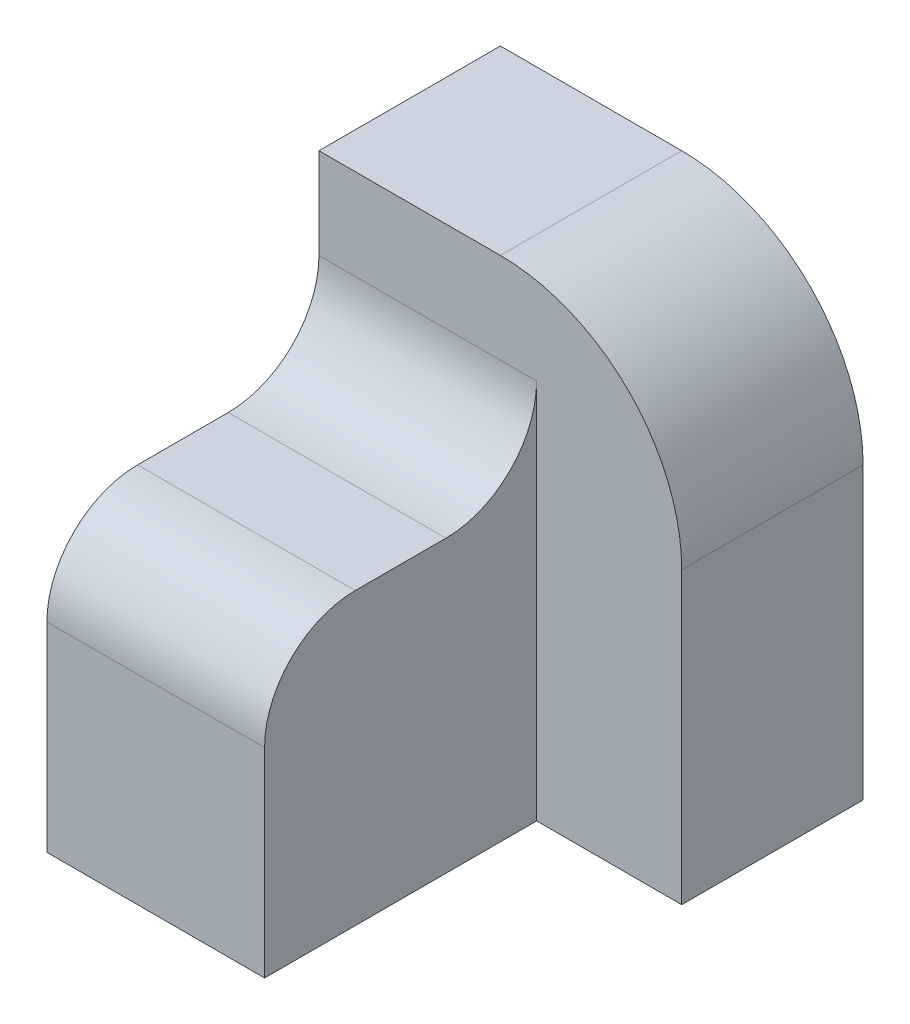
ISO-10303-21;
HEADER;
FILE_DESCRIPTION(('STEP AP214'),'2;1');
FILE_NAME('part.step','',(''),(''),'','','');
FILE_SCHEMA(('AUTOMOTIVE_DESIGN { 1 0 10303 214 1 1 1 1 }'));
ENDSEC;
DATA;
#1=APPLICATION_CONTEXT('core data for automotive mechanical design processes');
#2=APPLICATION_PROTOCOL_DEFINITION('international standard','automotive_design',2000,#1);
#3=PRODUCT_CONTEXT('',#1,'mechanical');
#4=PRODUCT('Part','Part','',(#3));
#5=PRODUCT_RELATED_PRODUCT_CATEGORY('part','',(#4));
#6=PRODUCT_DEFINITION_FORMATION('','',#4);
#7=PRODUCT_DEFINITION_CONTEXT('part definition',#1,'design');
#8=PRODUCT_DEFINITION('design','',#6,#7);
#9=PRODUCT_DEFINITION_SHAPE('','',#8);
#10=(LENGTH_UNIT() NAMED_UNIT(*) SI_UNIT(.MILLI.,.METRE.));
#11=(NAMED_UNIT(*) PLANE_ANGLE_UNIT() SI_UNIT($,.RADIAN.));
#12=(NAMED_UNIT(*) SI_UNIT($,.STERADIAN.) SOLID_ANGLE_UNIT());
#13=UNCERTAINTY_MEASURE_WITH_UNIT(LENGTH_MEASURE(1.E-05),#10,'distance_accuracy_value','');
#14=(GEOMETRIC_REPRESENTATION_CONTEXT(3) GLOBAL_UNCERTAINTY_ASSIGNED_CONTEXT((#13)) GLOBAL_UNIT_ASSIGNED_CONTEXT((#10,
#11,#12)) REPRESENTATION_CONTEXT('',''));
#15=CARTESIAN_POINT('',(0.,0.,0.));
#16=DIRECTION('',(0.,0.,1.));
#17=DIRECTION('',(1.,0.,0.));
#18=AXIS2_PLACEMENT_3D('',#15,#16,#17);
#19=CARTESIAN_POINT('',(0.,52.,-30.));
#20=DIRECTION('',(0.,0.,1.));
#21=DIRECTION('',(1.,0.,0.));
#22=AXIS2_PLACEMENT_3D('',#19,#20,#21);
#23=PLANE('',#22);
#24=DIRECTION('',(0.,-1.,0.));
#25=VECTOR('',#24,1.);
#26=CARTESIAN_POINT('',(40.,52.,-30.));
#27=LINE('',#26,#25);
#28=CARTESIAN_POINT('',(40.,32.,-30.));
#29=VERTEX_POINT('',#28);
#30=CARTESIAN_POINT('',(40.,0.,-30.));
#31=VERTEX_POINT('',#30);
#32=EDGE_CURVE('E134',#29,#31,#27,.T.);
#33=ORIENTED_EDGE('',*,*,#32,.F.);
#34=CARTESIAN_POINT('',(20.,32.,-30.));
#35=DIRECTION('',(0.,0.,1.));
#36=DIRECTION('',(1.,0.,0.));
#37=AXIS2_PLACEMENT_3D('',#34,#35,#36);
#38=CIRCLE('',#37,20.);
#39=CARTESIAN_POINT('',(20.,52.,-30.));
#40=VERTEX_POINT('',#39);
#41=EDGE_CURVE('E115',#40,#29,#38,.F.);
#42=ORIENTED_EDGE('',*,*,#41,.F.);
#43=DIRECTION('',(-1.,0.,0.));
#44=VECTOR('',#43,1.);
#45=CARTESIAN_POINT('',(0.,52.,-30.));
#46=LINE('',#45,#44);
#47=CARTESIAN_POINT('',(0.,52.,-30.));
#48=VERTEX_POINT('',#47);
#49=EDGE_CURVE('E311',#40,#48,#46,.T.);
#50=ORIENTED_EDGE('',*,*,#49,.T.);
#51=DIRECTION('',(0.,-1.,0.));
#52=VECTOR('',#51,1.);
#53=CARTESIAN_POINT('',(0.,52.,-30.));
#54=LINE('',#53,#52);
#55=CARTESIAN_POINT('',(0.,42.,-30.));
#56=VERTEX_POINT('',#55);
#57=EDGE_CURVE('E60',#48,#56,#54,.T.);
#58=ORIENTED_EDGE('',*,*,#57,.T.);
#59=DIRECTION('',(-1.,0.,0.));
#60=VECTOR('',#59,1.);
#61=CARTESIAN_POINT('',(119.057565652784,42.,-30.));
#62=LINE('',#61,#60);
#63=CARTESIAN_POINT('',(24.,42.,-30.));
#64=VERTEX_POINT('',#63);
#65=EDGE_CURVE('E137',#64,#56,#62,.T.);
#66=ORIENTED_EDGE('',*,*,#65,.F.);
#67=DIRECTION('',(0.,-1.,0.));
#68=VECTOR('',#67,1.);
#69=CARTESIAN_POINT('',(24.,60.,-30.));
#70=LINE('',#69,#68);
#71=CARTESIAN_POINT('',(24.,0.,-30.));
#72=VERTEX_POINT('',#71);
#73=EDGE_CURVE('E172',#64,#72,#70,.T.);
#74=ORIENTED_EDGE('',*,*,#73,.T.);
#75=DIRECTION('',(-1.,0.,0.));
#76=VECTOR('',#75,1.);
#77=CARTESIAN_POINT('',(0.,0.,-30.));
#78=LINE('',#77,#76);
#79=EDGE_CURVE('E199',#31,#72,#78,.T.);
#80=ORIENTED_EDGE('',*,*,#79,.F.);
#81=EDGE_LOOP('',(#33,#42,#50,#58,#66,#74,#80));
#82=FACE_BOUND('',#81,.T.);
#83=ADVANCED_FACE('F37',(#82),#23,.T.);
#84=CARTESIAN_POINT('',(0.,52.,-50.));
#85=DIRECTION('',(0.,0.,-1.));
#86=DIRECTION('',(-1.,0.,0.));
#87=AXIS2_PLACEMENT_3D('',#84,#85,#86);
#88=PLANE('',#87);
#89=DIRECTION('',(1.,0.,0.));
#90=VECTOR('',#89,1.);
#91=CARTESIAN_POINT('',(0.,52.,-50.));
#92=LINE('',#91,#90);
#93=CARTESIAN_POINT('',(0.,52.,-50.));
#94=VERTEX_POINT('',#93);
#95=CARTESIAN_POINT('',(20.,52.,-50.));
#96=VERTEX_POINT('',#95);
#97=EDGE_CURVE('E128',#94,#96,#92,.T.);
#98=ORIENTED_EDGE('',*,*,#97,.T.);
#99=CARTESIAN_POINT('',(20.,32.,-50.));
#100=DIRECTION('',(0.,0.,1.));
#101=DIRECTION('',(1.,0.,0.));
#102=AXIS2_PLACEMENT_3D('',#99,#100,#101);
#103=CIRCLE('',#102,20.);
#104=CARTESIAN_POINT('',(40.,32.,-50.));
#105=VERTEX_POINT('',#104);
#106=EDGE_CURVE('E52',#96,#105,#103,.F.);
#107=ORIENTED_EDGE('',*,*,#106,.T.);
#108=DIRECTION('',(0.,-1.,0.));
#109=VECTOR('',#108,1.);
#110=CARTESIAN_POINT('',(40.,52.,-50.));
#111=LINE('',#110,#109);
#112=CARTESIAN_POINT('',(40.,0.,-50.));
#113=VERTEX_POINT('',#112);
#114=EDGE_CURVE('E125',#105,#113,#111,.T.);
#115=ORIENTED_EDGE('',*,*,#114,.T.);
#116=DIRECTION('',(1.,0.,0.));
#117=VECTOR('',#116,1.);
#118=CARTESIAN_POINT('',(0.,0.,-50.));
#119=LINE('',#118,#117);
#120=CARTESIAN_POINT('',(0.,0.,-50.));
#121=VERTEX_POINT('',#120);
#122=EDGE_CURVE('E314',#121,#113,#119,.T.);
#123=ORIENTED_EDGE('',*,*,#122,.F.);
#124=DIRECTION('',(0.,-1.,0.));
#125=VECTOR('',#124,1.);
#126=CARTESIAN_POINT('',(0.,52.,-50.));
#127=LINE('',#126,#125);
#128=EDGE_CURVE('E135',#94,#121,#127,.T.);
#129=ORIENTED_EDGE('',*,*,#128,.F.);
#130=EDGE_LOOP('',(#98,#107,#115,#123,#129));
#131=FACE_BOUND('',#130,.T.);
#132=ADVANCED_FACE('F123',(#131),#88,.T.);
#133=CARTESIAN_POINT('',(0.,52.,0.));
#134=DIRECTION('',(0.,1.,0.));
#135=DIRECTION('',(0.,0.,1.));
#136=AXIS2_PLACEMENT_3D('',#133,#134,#135);
#137=PLANE('',#136);
#138=ORIENTED_EDGE('',*,*,#49,.F.);
#139=DIRECTION('',(0.,0.,-1.));
#140=VECTOR('',#139,1.);
#141=CARTESIAN_POINT('',(20.,52.,110.607953136506));
#142=LINE('',#141,#140);
#143=EDGE_CURVE('E119',#40,#96,#142,.T.);
#144=ORIENTED_EDGE('',*,*,#143,.T.);
#145=ORIENTED_EDGE('',*,*,#97,.F.);
#146=DIRECTION('',(0.,0.,-1.));
#147=VECTOR('',#146,1.);
#148=CARTESIAN_POINT('',(0.,52.,0.));
#149=LINE('',#148,#147);
#150=EDGE_CURVE('E313',#48,#94,#149,.T.);
#151=ORIENTED_EDGE('',*,*,#150,.F.);
#152=EDGE_LOOP('',(#138,#144,#145,#151));
#153=FACE_BOUND('',#152,.T.);
#154=ADVANCED_FACE('F217',(#153),#137,.T.);
#155=CARTESIAN_POINT('',(0.,60.,0.));
#156=DIRECTION('',(0.,0.,1.));
#157=DIRECTION('',(1.,0.,0.));
#158=AXIS2_PLACEMENT_3D('',#155,#156,#157);
#159=PLANE('',#158);
#160=DIRECTION('',(0.,-1.,0.));
#161=VECTOR('',#160,1.);
#162=CARTESIAN_POINT('',(24.,60.,0.));
#163=LINE('',#162,#161);
#164=CARTESIAN_POINT('',(24.,22.,0.));
#165=VERTEX_POINT('',#164);
#166=CARTESIAN_POINT('',(24.,0.,0.));
#167=VERTEX_POINT('',#166);
#168=EDGE_CURVE('E174',#165,#167,#163,.T.);
#169=ORIENTED_EDGE('',*,*,#168,.F.);
#170=DIRECTION('',(-1.,0.,0.));
#171=VECTOR('',#170,1.);
#172=CARTESIAN_POINT('',(119.057565652784,22.,0.));
#173=LINE('',#172,#171);
#174=CARTESIAN_POINT('',(0.,22.,0.));
#175=VERTEX_POINT('',#174);
#176=EDGE_CURVE('E150',#165,#175,#173,.T.);
#177=ORIENTED_EDGE('',*,*,#176,.T.);
#178=DIRECTION('',(0.,-1.,0.));
#179=VECTOR('',#178,1.);
#180=CARTESIAN_POINT('',(0.,60.,0.));
#181=LINE('',#180,#179);
#182=CARTESIAN_POINT('',(0.,0.,0.));
#183=VERTEX_POINT('',#182);
#184=EDGE_CURVE('E170',#175,#183,#181,.T.);
#185=ORIENTED_EDGE('',*,*,#184,.T.);
#186=DIRECTION('',(-1.,0.,0.));
#187=VECTOR('',#186,1.);
#188=CARTESIAN_POINT('',(0.,0.,0.));
#189=LINE('',#188,#187);
#190=EDGE_CURVE('E162',#167,#183,#189,.T.);
#191=ORIENTED_EDGE('',*,*,#190,.F.);
#192=EDGE_LOOP('',(#169,#177,#185,#191));
#193=FACE_BOUND('',#192,.T.);
#194=ADVANCED_FACE('F39',(#193),#159,.T.);
#195=CARTESIAN_POINT('',(24.,60.,0.));
#196=DIRECTION('',(1.,0.,0.));
#197=DIRECTION('',(0.,0.,-1.));
#198=AXIS2_PLACEMENT_3D('',#195,#196,#197);
#199=PLANE('',#198);
#200=DIRECTION('',(0.,0.,1.));
#201=VECTOR('',#200,1.);
#202=CARTESIAN_POINT('',(24.,32.,0.));
#203=LINE('',#202,#201);
#204=CARTESIAN_POINT('',(24.,32.,-20.));
#205=VERTEX_POINT('',#204);
#206=CARTESIAN_POINT('',(24.,32.,-10.));
#207=VERTEX_POINT('',#206);
#208=EDGE_CURVE('E156',#205,#207,#203,.T.);
#209=ORIENTED_EDGE('',*,*,#208,.T.);
#210=CARTESIAN_POINT('',(24.,22.,-10.));
#211=DIRECTION('',(1.,0.,0.));
#212=DIRECTION('',(0.,0.,-1.));
#213=AXIS2_PLACEMENT_3D('',#210,#211,#212);
#214=CIRCLE('',#213,10.);
#215=EDGE_CURVE('E159',#207,#165,#214,.T.);
#216=ORIENTED_EDGE('',*,*,#215,.T.);
#217=ORIENTED_EDGE('',*,*,#168,.T.);
#218=DIRECTION('',(0.,0.,1.));
#219=VECTOR('',#218,1.);
#220=CARTESIAN_POINT('',(24.,0.,0.));
#221=LINE('',#220,#219);
#222=EDGE_CURVE('E165',#72,#167,#221,.T.);
#223=ORIENTED_EDGE('',*,*,#222,.F.);
#224=ORIENTED_EDGE('',*,*,#73,.F.);
#225=CARTESIAN_POINT('',(24.,42.,-20.));
#226=DIRECTION('',(1.,0.,0.));
#227=DIRECTION('',(0.,0.,-1.));
#228=AXIS2_PLACEMENT_3D('',#225,#226,#227);
#229=CIRCLE('',#228,10.);
#230=EDGE_CURVE('E153',#64,#205,#229,.F.);
#231=ORIENTED_EDGE('',*,*,#230,.T.);
#232=EDGE_LOOP('',(#209,#216,#217,#223,#224,#231));
#233=FACE_BOUND('',#232,.T.);
#234=ADVANCED_FACE('F190',(#233),#199,.T.);
#235=CARTESIAN_POINT('',(0.,60.,0.));
#236=DIRECTION('',(-1.,0.,0.));
#237=DIRECTION('',(0.,0.,1.));
#238=AXIS2_PLACEMENT_3D('',#235,#236,#237);
#239=PLANE('',#238);
#240=ORIENTED_EDGE('',*,*,#184,.F.);
#241=CARTESIAN_POINT('',(0.,22.,-10.));
#242=DIRECTION('',(-1.,0.,0.));
#243=DIRECTION('',(0.,0.,1.));
#244=AXIS2_PLACEMENT_3D('',#241,#242,#243);
#245=CIRCLE('',#244,10.);
#246=CARTESIAN_POINT('',(0.,32.,-10.));
#247=VERTEX_POINT('',#246);
#248=EDGE_CURVE('E11',#175,#247,#245,.T.);
#249=ORIENTED_EDGE('',*,*,#248,.T.);
#250=DIRECTION('',(0.,0.,-1.));
#251=VECTOR('',#250,1.);
#252=CARTESIAN_POINT('',(0.,32.,0.));
#253=LINE('',#252,#251);
#254=CARTESIAN_POINT('',(0.,32.,-20.));
#255=VERTEX_POINT('',#254);
#256=EDGE_CURVE('E45',#247,#255,#253,.T.);
#257=ORIENTED_EDGE('',*,*,#256,.T.);
#258=CARTESIAN_POINT('',(0.,42.,-20.));
#259=DIRECTION('',(-1.,0.,0.));
#260=DIRECTION('',(0.,0.,1.));
#261=AXIS2_PLACEMENT_3D('',#258,#259,#260);
#262=CIRCLE('',#261,10.);
#263=EDGE_CURVE('E176',#255,#56,#262,.F.);
#264=ORIENTED_EDGE('',*,*,#263,.T.);
#265=ORIENTED_EDGE('',*,*,#57,.F.);
#266=ORIENTED_EDGE('',*,*,#150,.T.);
#267=ORIENTED_EDGE('',*,*,#128,.T.);
#268=DIRECTION('',(0.,0.,-1.));
#269=VECTOR('',#268,1.);
#270=CARTESIAN_POINT('',(0.,0.,0.));
#271=LINE('',#270,#269);
#272=EDGE_CURVE('E168',#183,#121,#271,.T.);
#273=ORIENTED_EDGE('',*,*,#272,.F.);
#274=EDGE_LOOP('',(#240,#249,#257,#264,#265,#266,#267,#273));
#275=FACE_BOUND('',#274,.T.);
#276=ADVANCED_FACE('F181',(#275),#239,.T.);
#277=CARTESIAN_POINT('',(0.,0.,0.));
#278=DIRECTION('',(0.,1.,0.));
#279=DIRECTION('',(0.,0.,1.));
#280=AXIS2_PLACEMENT_3D('',#277,#278,#279);
#281=PLANE('',#280);
#282=ORIENTED_EDGE('',*,*,#190,.T.);
#283=ORIENTED_EDGE('',*,*,#272,.T.);
#284=ORIENTED_EDGE('',*,*,#122,.T.);
#285=DIRECTION('',(0.,0.,1.));
#286=VECTOR('',#285,1.);
#287=CARTESIAN_POINT('',(40.,0.,0.));
#288=LINE('',#287,#286);
#289=EDGE_CURVE('E132',#113,#31,#288,.T.);
#290=ORIENTED_EDGE('',*,*,#289,.T.);
#291=ORIENTED_EDGE('',*,*,#79,.T.);
#292=ORIENTED_EDGE('',*,*,#222,.T.);
#293=EDGE_LOOP('',(#282,#283,#284,#290,#291,#292));
#294=FACE_BOUND('',#293,.T.);
#295=ADVANCED_FACE('F197',(#294),#281,.F.);
#296=CARTESIAN_POINT('',(119.057565652784,22.,-10.));
#297=DIRECTION('',(-1.,0.,0.));
#298=DIRECTION('',(0.,0.,1.));
#299=AXIS2_PLACEMENT_3D('',#296,#297,#298);
#300=CYLINDRICAL_SURFACE('',#299,10.);
#301=ORIENTED_EDGE('',*,*,#215,.F.);
#302=DIRECTION('',(-1.,0.,0.));
#303=VECTOR('',#302,1.);
#304=CARTESIAN_POINT('',(119.057565652784,32.,-10.));
#305=LINE('',#304,#303);
#306=EDGE_CURVE('E147',#207,#247,#305,.T.);
#307=ORIENTED_EDGE('',*,*,#306,.T.);
#308=ORIENTED_EDGE('',*,*,#248,.F.);
#309=ORIENTED_EDGE('',*,*,#176,.F.);
#310=EDGE_LOOP('',(#301,#307,#308,#309));
#311=FACE_BOUND('',#310,.T.);
#312=ADVANCED_FACE('F187',(#311),#300,.T.);
#313=CARTESIAN_POINT('',(119.057565652784,32.,-10.));
#314=DIRECTION('',(0.,1.,0.));
#315=DIRECTION('',(0.,0.,1.));
#316=AXIS2_PLACEMENT_3D('',#313,#314,#315);
#317=PLANE('',#316);
#318=ORIENTED_EDGE('',*,*,#208,.F.);
#319=DIRECTION('',(-1.,0.,0.));
#320=VECTOR('',#319,1.);
#321=CARTESIAN_POINT('',(119.057565652784,32.,-20.));
#322=LINE('',#321,#320);
#323=EDGE_CURVE('E144',#205,#255,#322,.T.);
#324=ORIENTED_EDGE('',*,*,#323,.T.);
#325=ORIENTED_EDGE('',*,*,#256,.F.);
#326=ORIENTED_EDGE('',*,*,#306,.F.);
#327=EDGE_LOOP('',(#318,#324,#325,#326));
#328=FACE_BOUND('',#327,.T.);
#329=ADVANCED_FACE('F184',(#328),#317,.T.);
#330=CARTESIAN_POINT('',(119.057565652784,42.,-20.));
#331=DIRECTION('',(-1.,0.,0.));
#332=DIRECTION('',(0.,0.,1.));
#333=AXIS2_PLACEMENT_3D('',#330,#331,#332);
#334=CYLINDRICAL_SURFACE('',#333,10.);
#335=ORIENTED_EDGE('',*,*,#230,.F.);
#336=ORIENTED_EDGE('',*,*,#65,.T.);
#337=ORIENTED_EDGE('',*,*,#263,.F.);
#338=ORIENTED_EDGE('',*,*,#323,.F.);
#339=EDGE_LOOP('',(#335,#336,#337,#338));
#340=FACE_BOUND('',#339,.T.);
#341=ADVANCED_FACE('F203',(#340),#334,.F.);
#342=CARTESIAN_POINT('',(40.,52.,0.));
#343=DIRECTION('',(1.,0.,0.));
#344=DIRECTION('',(0.,0.,-1.));
#345=AXIS2_PLACEMENT_3D('',#342,#343,#344);
#346=PLANE('',#345);
#347=DIRECTION('',(0.,0.,-1.));
#348=VECTOR('',#347,1.);
#349=CARTESIAN_POINT('',(40.,32.,110.607953136506));
#350=LINE('',#349,#348);
#351=EDGE_CURVE('E112',#29,#105,#350,.T.);
#352=ORIENTED_EDGE('',*,*,#351,.F.);
#353=ORIENTED_EDGE('',*,*,#32,.T.);
#354=ORIENTED_EDGE('',*,*,#289,.F.);
#355=ORIENTED_EDGE('',*,*,#114,.F.);
#356=EDGE_LOOP('',(#352,#353,#354,#355));
#357=FACE_BOUND('',#356,.T.);
#358=ADVANCED_FACE('F130',(#357),#346,.T.);
#359=CARTESIAN_POINT('',(20.,32.,110.607953136506));
#360=DIRECTION('',(0.,0.,-1.));
#361=DIRECTION('',(-1.,0.,0.));
#362=AXIS2_PLACEMENT_3D('',#359,#360,#361);
#363=CYLINDRICAL_SURFACE('',#362,20.);
#364=ORIENTED_EDGE('',*,*,#143,.F.);
#365=ORIENTED_EDGE('',*,*,#41,.T.);
#366=ORIENTED_EDGE('',*,*,#351,.T.);
#367=ORIENTED_EDGE('',*,*,#106,.F.);
#368=EDGE_LOOP('',(#364,#365,#366,#367));
#369=FACE_BOUND('',#368,.T.);
#370=ADVANCED_FACE('F113',(#369),#363,.T.);
#371=CLOSED_SHELL('',(#83,#132,#154,#194,#234,#276,#295,#312,#329,#341,#358,#370));
#372=MANIFOLD_SOLID_BREP('B2',#371);
#373=ADVANCED_BREP_SHAPE_REPRESENTATION('',(#18,#372),#14);
#374=SHAPE_DEFINITION_REPRESENTATION(#9,#373);
ENDSEC;
END-ISO-10303-21;
